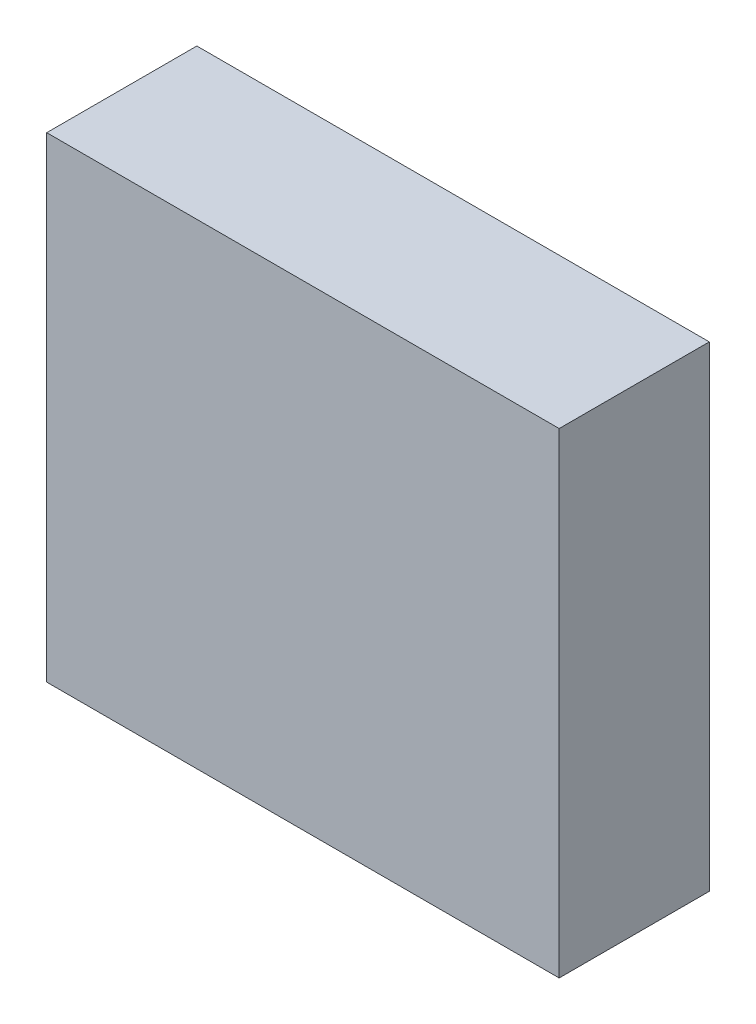
ISO-10303-21;
HEADER;
FILE_DESCRIPTION(('STEP AP214'),'2;1');
FILE_NAME('part.step','',(''),(''),'','','');
FILE_SCHEMA(('AUTOMOTIVE_DESIGN { 1 0 10303 214 1 1 1 1 }'));
ENDSEC;
DATA;
#1=APPLICATION_CONTEXT('core data for automotive mechanical design processes');
#2=APPLICATION_PROTOCOL_DEFINITION('international standard','automotive_design',2000,#1);
#3=PRODUCT_CONTEXT('',#1,'mechanical');
#4=PRODUCT('Part','Part','',(#3));
#5=PRODUCT_RELATED_PRODUCT_CATEGORY('part','',(#4));
#6=PRODUCT_DEFINITION_FORMATION('','',#4);
#7=PRODUCT_DEFINITION_CONTEXT('part definition',#1,'design');
#8=PRODUCT_DEFINITION('design','',#6,#7);
#9=PRODUCT_DEFINITION_SHAPE('','',#8);
#10=(LENGTH_UNIT() NAMED_UNIT(*) SI_UNIT(.MILLI.,.METRE.));
#11=(NAMED_UNIT(*) PLANE_ANGLE_UNIT() SI_UNIT($,.RADIAN.));
#12=(NAMED_UNIT(*) SI_UNIT($,.STERADIAN.) SOLID_ANGLE_UNIT());
#13=UNCERTAINTY_MEASURE_WITH_UNIT(LENGTH_MEASURE(1.E-05),#10,'distance_accuracy_value','');
#14=(GEOMETRIC_REPRESENTATION_CONTEXT(3) GLOBAL_UNCERTAINTY_ASSIGNED_CONTEXT((#13)) GLOBAL_UNIT_ASSIGNED_CONTEXT((#10,
#11,#12)) REPRESENTATION_CONTEXT('',''));
#15=CARTESIAN_POINT('',(0.,0.,0.));
#16=DIRECTION('',(0.,0.,1.));
#17=DIRECTION('',(1.,0.,0.));
#18=AXIS2_PLACEMENT_3D('',#15,#16,#17);
#19=CARTESIAN_POINT('',(1.270000012702E-06,0.,0.41010078));
#20=DIRECTION('',(0.,0.,1.));
#21=DIRECTION('',(1.,0.,0.));
#22=AXIS2_PLACEMENT_3D('',#19,#20,#21);
#23=PLANE('',#22);
#24=DIRECTION('',(1.95384244606618E-06,0.999999999998091,0.));
#25=VECTOR('',#24,1.);
#26=CARTESIAN_POINT('',(0.70000114,-0.65000124,0.41010078));
#27=LINE('',#26,#25);
#28=CARTESIAN_POINT('',(0.70000114,-0.65000124,0.41010078));
#29=VERTEX_POINT('',#28);
#30=CARTESIAN_POINT('',(0.70000368,0.65000124,0.41010078));
#31=VERTEX_POINT('',#30);
#32=EDGE_CURVE('E87',#29,#31,#27,.T.);
#33=ORIENTED_EDGE('',*,*,#32,.T.);
#34=DIRECTION('',(-1.,0.,0.));
#35=VECTOR('',#34,1.);
#36=CARTESIAN_POINT('',(0.70000368,0.65000124,0.41010078));
#37=LINE('',#36,#35);
#38=CARTESIAN_POINT('',(-0.6999986,0.65000124,0.41010078));
#39=VERTEX_POINT('',#38);
#40=EDGE_CURVE('E104',#31,#39,#37,.T.);
#41=ORIENTED_EDGE('',*,*,#40,.T.);
#42=DIRECTION('',(-1.95384244606618E-06,-0.999999999998091,0.));
#43=VECTOR('',#42,1.);
#44=CARTESIAN_POINT('',(-0.6999986,0.65000124,0.41010078));
#45=LINE('',#44,#43);
#46=CARTESIAN_POINT('',(-0.70000114,-0.65000124,0.41010078));
#47=VERTEX_POINT('',#46);
#48=EDGE_CURVE('E71',#39,#47,#45,.T.);
#49=ORIENTED_EDGE('',*,*,#48,.T.);
#50=DIRECTION('',(1.,0.,0.));
#51=VECTOR('',#50,1.);
#52=CARTESIAN_POINT('',(-0.70000114,-0.65000124,0.41010078));
#53=LINE('',#52,#51);
#54=EDGE_CURVE('E11',#47,#29,#53,.T.);
#55=ORIENTED_EDGE('',*,*,#54,.T.);
#56=EDGE_LOOP('',(#33,#41,#49,#55));
#57=FACE_BOUND('',#56,.T.);
#58=ADVANCED_FACE('F16',(#57),#23,.T.);
#59=CARTESIAN_POINT('',(1.270000012702E-06,0.,0.));
#60=DIRECTION('',(0.,0.,1.));
#61=DIRECTION('',(1.,0.,0.));
#62=AXIS2_PLACEMENT_3D('',#59,#60,#61);
#63=PLANE('',#62);
#64=DIRECTION('',(1.95384244606618E-06,0.999999999998091,0.));
#65=VECTOR('',#64,1.);
#66=CARTESIAN_POINT('',(0.70000114,-0.65000124,0.));
#67=LINE('',#66,#65);
#68=CARTESIAN_POINT('',(0.70000114,-0.65000124,0.));
#69=VERTEX_POINT('',#68);
#70=CARTESIAN_POINT('',(0.70000368,0.65000124,0.));
#71=VERTEX_POINT('',#70);
#72=EDGE_CURVE('E75',#69,#71,#67,.T.);
#73=ORIENTED_EDGE('',*,*,#72,.F.);
#74=DIRECTION('',(1.,0.,0.));
#75=VECTOR('',#74,1.);
#76=CARTESIAN_POINT('',(-0.70000114,-0.65000124,0.));
#77=LINE('',#76,#75);
#78=CARTESIAN_POINT('',(-0.70000114,-0.65000124,0.));
#79=VERTEX_POINT('',#78);
#80=EDGE_CURVE('E27',#79,#69,#77,.T.);
#81=ORIENTED_EDGE('',*,*,#80,.F.);
#82=DIRECTION('',(-1.95384244606618E-06,-0.999999999998091,0.));
#83=VECTOR('',#82,1.);
#84=CARTESIAN_POINT('',(-0.6999986,0.65000124,0.));
#85=LINE('',#84,#83);
#86=CARTESIAN_POINT('',(-0.6999986,0.65000124,0.));
#87=VERTEX_POINT('',#86);
#88=EDGE_CURVE('E101',#87,#79,#85,.T.);
#89=ORIENTED_EDGE('',*,*,#88,.F.);
#90=DIRECTION('',(-1.,0.,0.));
#91=VECTOR('',#90,1.);
#92=CARTESIAN_POINT('',(0.70000368,0.65000124,0.));
#93=LINE('',#92,#91);
#94=EDGE_CURVE('E20',#71,#87,#93,.T.);
#95=ORIENTED_EDGE('',*,*,#94,.F.);
#96=EDGE_LOOP('',(#73,#81,#89,#95));
#97=FACE_BOUND('',#96,.T.);
#98=ADVANCED_FACE('F76',(#97),#63,.F.);
#99=CARTESIAN_POINT('',(-0.70000114,-0.65000124,0.));
#100=DIRECTION('',(0.,1.,0.));
#101=DIRECTION('',(1.,0.,0.));
#102=AXIS2_PLACEMENT_3D('',#99,#100,#101);
#103=PLANE('',#102);
#104=DIRECTION('',(0.,0.,1.));
#105=VECTOR('',#104,1.);
#106=CARTESIAN_POINT('',(-0.70000114,-0.65000124,0.));
#107=LINE('',#106,#105);
#108=EDGE_CURVE('E67',#79,#47,#107,.T.);
#109=ORIENTED_EDGE('',*,*,#108,.F.);
#110=ORIENTED_EDGE('',*,*,#80,.T.);
#111=DIRECTION('',(0.,0.,1.));
#112=VECTOR('',#111,1.);
#113=CARTESIAN_POINT('',(0.70000114,-0.65000124,0.));
#114=LINE('',#113,#112);
#115=EDGE_CURVE('E65',#69,#29,#114,.T.);
#116=ORIENTED_EDGE('',*,*,#115,.T.);
#117=ORIENTED_EDGE('',*,*,#54,.F.);
#118=EDGE_LOOP('',(#109,#110,#116,#117));
#119=FACE_BOUND('',#118,.T.);
#120=ADVANCED_FACE('F63',(#119),#103,.F.);
#121=CARTESIAN_POINT('',(-0.6999986,0.65000124,0.));
#122=DIRECTION('',(0.999999999998091,-1.95384244606618E-06,0.));
#123=DIRECTION('',(0.,0.,-1.));
#124=AXIS2_PLACEMENT_3D('',#121,#122,#123);
#125=PLANE('',#124);
#126=DIRECTION('',(0.,0.,1.));
#127=VECTOR('',#126,1.);
#128=CARTESIAN_POINT('',(-0.6999986,0.65000124,0.));
#129=LINE('',#128,#127);
#130=EDGE_CURVE('E94',#87,#39,#129,.T.);
#131=ORIENTED_EDGE('',*,*,#130,.F.);
#132=ORIENTED_EDGE('',*,*,#88,.T.);
#133=ORIENTED_EDGE('',*,*,#108,.T.);
#134=ORIENTED_EDGE('',*,*,#48,.F.);
#135=EDGE_LOOP('',(#131,#132,#133,#134));
#136=FACE_BOUND('',#135,.T.);
#137=ADVANCED_FACE('F165',(#136),#125,.F.);
#138=CARTESIAN_POINT('',(0.70000368,0.65000124,0.));
#139=DIRECTION('',(0.,-1.,0.));
#140=DIRECTION('',(0.,0.,-1.));
#141=AXIS2_PLACEMENT_3D('',#138,#139,#140);
#142=PLANE('',#141);
#143=DIRECTION('',(0.,0.,1.));
#144=VECTOR('',#143,1.);
#145=CARTESIAN_POINT('',(0.70000368,0.65000124,0.));
#146=LINE('',#145,#144);
#147=EDGE_CURVE('E82',#71,#31,#146,.T.);
#148=ORIENTED_EDGE('',*,*,#147,.F.);
#149=ORIENTED_EDGE('',*,*,#94,.T.);
#150=ORIENTED_EDGE('',*,*,#130,.T.);
#151=ORIENTED_EDGE('',*,*,#40,.F.);
#152=EDGE_LOOP('',(#148,#149,#150,#151));
#153=FACE_BOUND('',#152,.T.);
#154=ADVANCED_FACE('F18',(#153),#142,.F.);
#155=CARTESIAN_POINT('',(0.70000114,-0.65000124,0.));
#156=DIRECTION('',(-0.999999999998091,1.95384244606618E-06,0.));
#157=DIRECTION('',(0.,0.,1.));
#158=AXIS2_PLACEMENT_3D('',#155,#156,#157);
#159=PLANE('',#158);
#160=ORIENTED_EDGE('',*,*,#115,.F.);
#161=ORIENTED_EDGE('',*,*,#72,.T.);
#162=ORIENTED_EDGE('',*,*,#147,.T.);
#163=ORIENTED_EDGE('',*,*,#32,.F.);
#164=EDGE_LOOP('',(#160,#161,#162,#163));
#165=FACE_BOUND('',#164,.T.);
#166=ADVANCED_FACE('F85',(#165),#159,.F.);
#167=CLOSED_SHELL('',(#58,#98,#120,#137,#154,#166));
#168=MANIFOLD_SOLID_BREP('B1',#167);
#169=ADVANCED_BREP_SHAPE_REPRESENTATION('',(#18,#168),#14);
#170=SHAPE_DEFINITION_REPRESENTATION(#9,#169);
ENDSEC;
END-ISO-10303-21;
